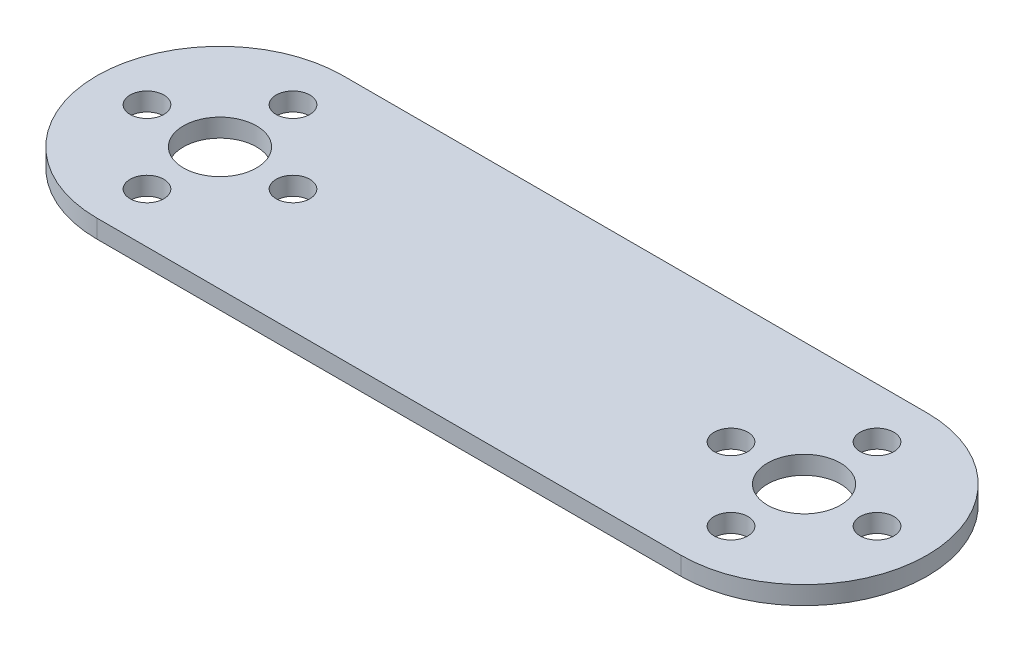
ISO-10303-21;
HEADER;
FILE_DESCRIPTION(('STEP AP214'),'2;1');
FILE_NAME('part.step','',(''),(''),'','','');
FILE_SCHEMA(('AUTOMOTIVE_DESIGN { 1 0 10303 214 1 1 1 1 }'));
ENDSEC;
DATA;
#1=APPLICATION_CONTEXT('core data for automotive mechanical design processes');
#2=APPLICATION_PROTOCOL_DEFINITION('international standard','automotive_design',2000,#1);
#3=PRODUCT_CONTEXT('',#1,'mechanical');
#4=PRODUCT('Part','Part','',(#3));
#5=PRODUCT_RELATED_PRODUCT_CATEGORY('part','',(#4));
#6=PRODUCT_DEFINITION_FORMATION('','',#4);
#7=PRODUCT_DEFINITION_CONTEXT('part definition',#1,'design');
#8=PRODUCT_DEFINITION('design','',#6,#7);
#9=PRODUCT_DEFINITION_SHAPE('','',#8);
#10=(LENGTH_UNIT() NAMED_UNIT(*) SI_UNIT(.MILLI.,.METRE.));
#11=(NAMED_UNIT(*) PLANE_ANGLE_UNIT() SI_UNIT($,.RADIAN.));
#12=(NAMED_UNIT(*) SI_UNIT($,.STERADIAN.) SOLID_ANGLE_UNIT());
#13=UNCERTAINTY_MEASURE_WITH_UNIT(LENGTH_MEASURE(1.E-05),#10,'distance_accuracy_value','');
#14=(GEOMETRIC_REPRESENTATION_CONTEXT(3) GLOBAL_UNCERTAINTY_ASSIGNED_CONTEXT((#13)) GLOBAL_UNIT_ASSIGNED_CONTEXT((#10,
#11,#12)) REPRESENTATION_CONTEXT('',''));
#15=CARTESIAN_POINT('',(0.,0.,0.));
#16=DIRECTION('',(0.,0.,1.));
#17=DIRECTION('',(1.,0.,0.));
#18=AXIS2_PLACEMENT_3D('',#15,#16,#17);
#19=CARTESIAN_POINT('',(-32.,0.,0.));
#20=DIRECTION('',(0.,-1.,0.));
#21=DIRECTION('',(0.,0.,-1.));
#22=AXIS2_PLACEMENT_3D('',#19,#20,#21);
#23=CYLINDRICAL_SURFACE('',#22,13.5);
#24=DIRECTION('',(0.,-1.,0.));
#25=VECTOR('',#24,1.);
#26=CARTESIAN_POINT('',(-32.,2.,-13.5));
#27=LINE('',#26,#25);
#28=CARTESIAN_POINT('',(-32.,0.,-13.5));
#29=VERTEX_POINT('',#28);
#30=CARTESIAN_POINT('',(-32.,2.,-13.5));
#31=VERTEX_POINT('',#30);
#32=EDGE_CURVE('E107',#29,#31,#27,.F.);
#33=ORIENTED_EDGE('',*,*,#32,.F.);
#34=CARTESIAN_POINT('',(-32.,0.,0.));
#35=DIRECTION('',(0.,-1.,0.));
#36=DIRECTION('',(0.,0.,-1.));
#37=AXIS2_PLACEMENT_3D('',#34,#35,#36);
#38=CIRCLE('',#37,13.5);
#39=CARTESIAN_POINT('',(-32.,0.,13.5));
#40=VERTEX_POINT('',#39);
#41=EDGE_CURVE('E24',#40,#29,#38,.T.);
#42=ORIENTED_EDGE('',*,*,#41,.F.);
#43=DIRECTION('',(0.,-1.,0.));
#44=VECTOR('',#43,1.);
#45=CARTESIAN_POINT('',(-32.,2.,13.5));
#46=LINE('',#45,#44);
#47=CARTESIAN_POINT('',(-32.,2.,13.5));
#48=VERTEX_POINT('',#47);
#49=EDGE_CURVE('E74',#48,#40,#46,.T.);
#50=ORIENTED_EDGE('',*,*,#49,.F.);
#51=CARTESIAN_POINT('',(-32.,2.,0.));
#52=DIRECTION('',(0.,-1.,0.));
#53=DIRECTION('',(0.,0.,-1.));
#54=AXIS2_PLACEMENT_3D('',#51,#52,#53);
#55=CIRCLE('',#54,13.5);
#56=EDGE_CURVE('E10',#31,#48,#55,.F.);
#57=ORIENTED_EDGE('',*,*,#56,.F.);
#58=EDGE_LOOP('',(#33,#42,#50,#57));
#59=FACE_BOUND('',#58,.T.);
#60=ADVANCED_FACE('F16',(#59),#23,.T.);
#61=CARTESIAN_POINT('',(32.,0.,0.));
#62=DIRECTION('',(0.,-1.,0.));
#63=DIRECTION('',(0.,0.,-1.));
#64=AXIS2_PLACEMENT_3D('',#61,#62,#63);
#65=CYLINDRICAL_SURFACE('',#64,13.5);
#66=DIRECTION('',(0.,-1.,0.));
#67=VECTOR('',#66,1.);
#68=CARTESIAN_POINT('',(32.,2.,13.5));
#69=LINE('',#68,#67);
#70=CARTESIAN_POINT('',(32.,0.,13.5));
#71=VERTEX_POINT('',#70);
#72=CARTESIAN_POINT('',(32.,2.,13.5));
#73=VERTEX_POINT('',#72);
#74=EDGE_CURVE('E73',#71,#73,#69,.F.);
#75=ORIENTED_EDGE('',*,*,#74,.F.);
#76=CARTESIAN_POINT('',(32.,0.,0.));
#77=DIRECTION('',(0.,-1.,0.));
#78=DIRECTION('',(0.,0.,-1.));
#79=AXIS2_PLACEMENT_3D('',#76,#77,#78);
#80=CIRCLE('',#79,13.5);
#81=CARTESIAN_POINT('',(32.,0.,-13.5));
#82=VERTEX_POINT('',#81);
#83=EDGE_CURVE('E81',#82,#71,#80,.T.);
#84=ORIENTED_EDGE('',*,*,#83,.F.);
#85=DIRECTION('',(0.,-1.,0.));
#86=VECTOR('',#85,1.);
#87=CARTESIAN_POINT('',(32.,2.,-13.5));
#88=LINE('',#87,#86);
#89=CARTESIAN_POINT('',(32.,2.,-13.5));
#90=VERTEX_POINT('',#89);
#91=EDGE_CURVE('E89',#90,#82,#88,.T.);
#92=ORIENTED_EDGE('',*,*,#91,.F.);
#93=CARTESIAN_POINT('',(32.,2.,0.));
#94=DIRECTION('',(0.,-1.,0.));
#95=DIRECTION('',(0.,0.,-1.));
#96=AXIS2_PLACEMENT_3D('',#93,#94,#95);
#97=CIRCLE('',#96,13.5);
#98=EDGE_CURVE('E88',#73,#90,#97,.F.);
#99=ORIENTED_EDGE('',*,*,#98,.F.);
#100=EDGE_LOOP('',(#75,#84,#92,#99));
#101=FACE_BOUND('',#100,.T.);
#102=ADVANCED_FACE('F92',(#101),#65,.T.);
#103=CARTESIAN_POINT('',(-45.5,2.,13.5));
#104=DIRECTION('',(0.,0.,-1.));
#105=DIRECTION('',(-1.,0.,0.));
#106=AXIS2_PLACEMENT_3D('',#103,#104,#105);
#107=PLANE('',#106);
#108=DIRECTION('',(1.,0.,0.));
#109=VECTOR('',#108,1.);
#110=CARTESIAN_POINT('',(-45.5,2.,13.5));
#111=LINE('',#110,#109);
#112=EDGE_CURVE('E101',#48,#73,#111,.T.);
#113=ORIENTED_EDGE('',*,*,#112,.F.);
#114=ORIENTED_EDGE('',*,*,#49,.T.);
#115=DIRECTION('',(1.,0.,0.));
#116=VECTOR('',#115,1.);
#117=CARTESIAN_POINT('',(-45.5,0.,13.5));
#118=LINE('',#117,#116);
#119=EDGE_CURVE('E68',#40,#71,#118,.T.);
#120=ORIENTED_EDGE('',*,*,#119,.T.);
#121=ORIENTED_EDGE('',*,*,#74,.T.);
#122=EDGE_LOOP('',(#113,#114,#120,#121));
#123=FACE_BOUND('',#122,.T.);
#124=ADVANCED_FACE('F71',(#123),#107,.F.);
#125=CARTESIAN_POINT('',(-45.5,2.,-13.5));
#126=DIRECTION('',(0.,0.,1.));
#127=DIRECTION('',(1.,0.,0.));
#128=AXIS2_PLACEMENT_3D('',#125,#126,#127);
#129=PLANE('',#128);
#130=DIRECTION('',(-1.,0.,0.));
#131=VECTOR('',#130,1.);
#132=CARTESIAN_POINT('',(-45.5,0.,-13.5));
#133=LINE('',#132,#131);
#134=EDGE_CURVE('E77',#82,#29,#133,.T.);
#135=ORIENTED_EDGE('',*,*,#134,.T.);
#136=ORIENTED_EDGE('',*,*,#32,.T.);
#137=DIRECTION('',(-1.,0.,0.));
#138=VECTOR('',#137,1.);
#139=CARTESIAN_POINT('',(-45.5,2.,-13.5));
#140=LINE('',#139,#138);
#141=EDGE_CURVE('E94',#90,#31,#140,.T.);
#142=ORIENTED_EDGE('',*,*,#141,.F.);
#143=ORIENTED_EDGE('',*,*,#91,.T.);
#144=EDGE_LOOP('',(#135,#136,#142,#143));
#145=FACE_BOUND('',#144,.T.);
#146=ADVANCED_FACE('F116',(#145),#129,.F.);
#147=CARTESIAN_POINT('',(-45.5,2.,-13.5));
#148=DIRECTION('',(0.,-1.,0.));
#149=DIRECTION('',(0.,0.,-1.));
#150=AXIS2_PLACEMENT_3D('',#147,#148,#149);
#151=PLANE('',#150);
#152=CARTESIAN_POINT('',(32.,2.,-8.));
#153=DIRECTION('',(0.,1.,0.));
#154=DIRECTION('',(0.,0.,1.));
#155=AXIS2_PLACEMENT_3D('',#152,#153,#154);
#156=CIRCLE('',#155,1.85);
#157=CARTESIAN_POINT('',(32.,2.,-6.15));
#158=VERTEX_POINT('',#157);
#159=EDGE_CURVE('E193',#158,#158,#156,.T.);
#160=ORIENTED_EDGE('',*,*,#159,.F.);
#161=EDGE_LOOP('',(#160));
#162=FACE_BOUND('',#161,.T.);
#163=CARTESIAN_POINT('',(32.,2.,8.));
#164=DIRECTION('',(0.,1.,0.));
#165=DIRECTION('',(0.,0.,1.));
#166=AXIS2_PLACEMENT_3D('',#163,#164,#165);
#167=CIRCLE('',#166,1.85);
#168=CARTESIAN_POINT('',(32.,2.,9.85));
#169=VERTEX_POINT('',#168);
#170=EDGE_CURVE('E185',#169,#169,#167,.T.);
#171=ORIENTED_EDGE('',*,*,#170,.F.);
#172=EDGE_LOOP('',(#171));
#173=FACE_BOUND('',#172,.T.);
#174=CARTESIAN_POINT('',(24.,2.,0.));
#175=DIRECTION('',(0.,1.,0.));
#176=DIRECTION('',(0.,0.,1.));
#177=AXIS2_PLACEMENT_3D('',#174,#175,#176);
#178=CIRCLE('',#177,1.85);
#179=CARTESIAN_POINT('',(24.,2.,1.85));
#180=VERTEX_POINT('',#179);
#181=EDGE_CURVE('E177',#180,#180,#178,.T.);
#182=ORIENTED_EDGE('',*,*,#181,.F.);
#183=EDGE_LOOP('',(#182));
#184=FACE_BOUND('',#183,.T.);
#185=CARTESIAN_POINT('',(40.,2.,0.));
#186=DIRECTION('',(0.,1.,0.));
#187=DIRECTION('',(0.,0.,1.));
#188=AXIS2_PLACEMENT_3D('',#185,#186,#187);
#189=CIRCLE('',#188,1.85);
#190=CARTESIAN_POINT('',(40.,2.,1.85));
#191=VERTEX_POINT('',#190);
#192=EDGE_CURVE('E169',#191,#191,#189,.T.);
#193=ORIENTED_EDGE('',*,*,#192,.F.);
#194=EDGE_LOOP('',(#193));
#195=FACE_BOUND('',#194,.T.);
#196=CARTESIAN_POINT('',(32.,2.,0.));
#197=DIRECTION('',(0.,1.,0.));
#198=DIRECTION('',(0.,0.,1.));
#199=AXIS2_PLACEMENT_3D('',#196,#197,#198);
#200=CIRCLE('',#199,4.);
#201=CARTESIAN_POINT('',(32.,2.,4.00000000000001));
#202=VERTEX_POINT('',#201);
#203=EDGE_CURVE('E161',#202,#202,#200,.T.);
#204=ORIENTED_EDGE('',*,*,#203,.F.);
#205=EDGE_LOOP('',(#204));
#206=FACE_BOUND('',#205,.T.);
#207=CARTESIAN_POINT('',(-32.,2.,-8.));
#208=DIRECTION('',(0.,1.,0.));
#209=DIRECTION('',(0.,0.,1.));
#210=AXIS2_PLACEMENT_3D('',#207,#208,#209);
#211=CIRCLE('',#210,1.85);
#212=CARTESIAN_POINT('',(-32.,2.,-6.15));
#213=VERTEX_POINT('',#212);
#214=EDGE_CURVE('E153',#213,#213,#211,.T.);
#215=ORIENTED_EDGE('',*,*,#214,.F.);
#216=EDGE_LOOP('',(#215));
#217=FACE_BOUND('',#216,.T.);
#218=CARTESIAN_POINT('',(-32.,2.,8.));
#219=DIRECTION('',(0.,1.,0.));
#220=DIRECTION('',(0.,0.,1.));
#221=AXIS2_PLACEMENT_3D('',#218,#219,#220);
#222=CIRCLE('',#221,1.85);
#223=CARTESIAN_POINT('',(-32.,2.,9.85));
#224=VERTEX_POINT('',#223);
#225=EDGE_CURVE('E145',#224,#224,#222,.T.);
#226=ORIENTED_EDGE('',*,*,#225,.F.);
#227=EDGE_LOOP('',(#226));
#228=FACE_BOUND('',#227,.T.);
#229=CARTESIAN_POINT('',(-40.,2.,0.));
#230=DIRECTION('',(0.,1.,0.));
#231=DIRECTION('',(0.,0.,1.));
#232=AXIS2_PLACEMENT_3D('',#229,#230,#231);
#233=CIRCLE('',#232,1.85);
#234=CARTESIAN_POINT('',(-40.,2.,1.85));
#235=VERTEX_POINT('',#234);
#236=EDGE_CURVE('E137',#235,#235,#233,.T.);
#237=ORIENTED_EDGE('',*,*,#236,.F.);
#238=EDGE_LOOP('',(#237));
#239=FACE_BOUND('',#238,.T.);
#240=CARTESIAN_POINT('',(-24.,2.,0.));
#241=DIRECTION('',(0.,1.,0.));
#242=DIRECTION('',(0.,0.,1.));
#243=AXIS2_PLACEMENT_3D('',#240,#241,#242);
#244=CIRCLE('',#243,1.85);
#245=CARTESIAN_POINT('',(-24.,2.,1.85));
#246=VERTEX_POINT('',#245);
#247=EDGE_CURVE('E129',#246,#246,#244,.T.);
#248=ORIENTED_EDGE('',*,*,#247,.F.);
#249=EDGE_LOOP('',(#248));
#250=FACE_BOUND('',#249,.T.);
#251=CARTESIAN_POINT('',(-32.,2.,0.));
#252=DIRECTION('',(0.,1.,0.));
#253=DIRECTION('',(0.,0.,1.));
#254=AXIS2_PLACEMENT_3D('',#251,#252,#253);
#255=CIRCLE('',#254,4.);
#256=CARTESIAN_POINT('',(-32.,2.,4.00000000000001));
#257=VERTEX_POINT('',#256);
#258=EDGE_CURVE('E78',#257,#257,#255,.T.);
#259=ORIENTED_EDGE('',*,*,#258,.F.);
#260=EDGE_LOOP('',(#259));
#261=FACE_BOUND('',#260,.T.);
#262=ORIENTED_EDGE('',*,*,#141,.T.);
#263=ORIENTED_EDGE('',*,*,#56,.T.);
#264=ORIENTED_EDGE('',*,*,#112,.T.);
#265=ORIENTED_EDGE('',*,*,#98,.T.);
#266=EDGE_LOOP('',(#262,#263,#264,#265));
#267=FACE_BOUND('',#266,.T.);
#268=ADVANCED_FACE('F214',(#162,#173,#184,#195,#206,#217,#228,#239,#250,#261,#267),#151,.F.);
#269=CARTESIAN_POINT('',(-45.5,0.,-13.5));
#270=DIRECTION('',(0.,-1.,0.));
#271=DIRECTION('',(0.,0.,-1.));
#272=AXIS2_PLACEMENT_3D('',#269,#270,#271);
#273=PLANE('',#272);
#274=CARTESIAN_POINT('',(32.,0.,-8.));
#275=DIRECTION('',(0.,1.,0.));
#276=DIRECTION('',(0.,0.,1.));
#277=AXIS2_PLACEMENT_3D('',#274,#275,#276);
#278=CIRCLE('',#277,1.85);
#279=CARTESIAN_POINT('',(32.,0.,-6.15));
#280=VERTEX_POINT('',#279);
#281=EDGE_CURVE('E197',#280,#280,#278,.T.);
#282=ORIENTED_EDGE('',*,*,#281,.T.);
#283=EDGE_LOOP('',(#282));
#284=FACE_BOUND('',#283,.T.);
#285=CARTESIAN_POINT('',(32.,0.,8.));
#286=DIRECTION('',(0.,1.,0.));
#287=DIRECTION('',(0.,0.,1.));
#288=AXIS2_PLACEMENT_3D('',#285,#286,#287);
#289=CIRCLE('',#288,1.85);
#290=CARTESIAN_POINT('',(32.,0.,9.85));
#291=VERTEX_POINT('',#290);
#292=EDGE_CURVE('E189',#291,#291,#289,.T.);
#293=ORIENTED_EDGE('',*,*,#292,.T.);
#294=EDGE_LOOP('',(#293));
#295=FACE_BOUND('',#294,.T.);
#296=CARTESIAN_POINT('',(24.,0.,0.));
#297=DIRECTION('',(0.,1.,0.));
#298=DIRECTION('',(0.,0.,1.));
#299=AXIS2_PLACEMENT_3D('',#296,#297,#298);
#300=CIRCLE('',#299,1.85);
#301=CARTESIAN_POINT('',(24.,0.,1.85));
#302=VERTEX_POINT('',#301);
#303=EDGE_CURVE('E181',#302,#302,#300,.T.);
#304=ORIENTED_EDGE('',*,*,#303,.T.);
#305=EDGE_LOOP('',(#304));
#306=FACE_BOUND('',#305,.T.);
#307=CARTESIAN_POINT('',(40.,0.,0.));
#308=DIRECTION('',(0.,1.,0.));
#309=DIRECTION('',(0.,0.,1.));
#310=AXIS2_PLACEMENT_3D('',#307,#308,#309);
#311=CIRCLE('',#310,1.85);
#312=CARTESIAN_POINT('',(40.,0.,1.85));
#313=VERTEX_POINT('',#312);
#314=EDGE_CURVE('E173',#313,#313,#311,.T.);
#315=ORIENTED_EDGE('',*,*,#314,.T.);
#316=EDGE_LOOP('',(#315));
#317=FACE_BOUND('',#316,.T.);
#318=CARTESIAN_POINT('',(32.,0.,0.));
#319=DIRECTION('',(0.,1.,0.));
#320=DIRECTION('',(0.,0.,1.));
#321=AXIS2_PLACEMENT_3D('',#318,#319,#320);
#322=CIRCLE('',#321,4.);
#323=CARTESIAN_POINT('',(32.,0.,4.00000000000001));
#324=VERTEX_POINT('',#323);
#325=EDGE_CURVE('E165',#324,#324,#322,.T.);
#326=ORIENTED_EDGE('',*,*,#325,.T.);
#327=EDGE_LOOP('',(#326));
#328=FACE_BOUND('',#327,.T.);
#329=CARTESIAN_POINT('',(-32.,0.,-8.));
#330=DIRECTION('',(0.,1.,0.));
#331=DIRECTION('',(0.,0.,1.));
#332=AXIS2_PLACEMENT_3D('',#329,#330,#331);
#333=CIRCLE('',#332,1.85);
#334=CARTESIAN_POINT('',(-32.,0.,-6.15));
#335=VERTEX_POINT('',#334);
#336=EDGE_CURVE('E157',#335,#335,#333,.T.);
#337=ORIENTED_EDGE('',*,*,#336,.T.);
#338=EDGE_LOOP('',(#337));
#339=FACE_BOUND('',#338,.T.);
#340=CARTESIAN_POINT('',(-32.,0.,8.));
#341=DIRECTION('',(0.,1.,0.));
#342=DIRECTION('',(0.,0.,1.));
#343=AXIS2_PLACEMENT_3D('',#340,#341,#342);
#344=CIRCLE('',#343,1.85);
#345=CARTESIAN_POINT('',(-32.,0.,9.85));
#346=VERTEX_POINT('',#345);
#347=EDGE_CURVE('E149',#346,#346,#344,.T.);
#348=ORIENTED_EDGE('',*,*,#347,.T.);
#349=EDGE_LOOP('',(#348));
#350=FACE_BOUND('',#349,.T.);
#351=CARTESIAN_POINT('',(-40.,0.,0.));
#352=DIRECTION('',(0.,1.,0.));
#353=DIRECTION('',(0.,0.,1.));
#354=AXIS2_PLACEMENT_3D('',#351,#352,#353);
#355=CIRCLE('',#354,1.85);
#356=CARTESIAN_POINT('',(-40.,0.,1.85));
#357=VERTEX_POINT('',#356);
#358=EDGE_CURVE('E141',#357,#357,#355,.T.);
#359=ORIENTED_EDGE('',*,*,#358,.T.);
#360=EDGE_LOOP('',(#359));
#361=FACE_BOUND('',#360,.T.);
#362=CARTESIAN_POINT('',(-24.,0.,0.));
#363=DIRECTION('',(0.,1.,0.));
#364=DIRECTION('',(0.,0.,1.));
#365=AXIS2_PLACEMENT_3D('',#362,#363,#364);
#366=CIRCLE('',#365,1.85);
#367=CARTESIAN_POINT('',(-24.,0.,1.85));
#368=VERTEX_POINT('',#367);
#369=EDGE_CURVE('E133',#368,#368,#366,.T.);
#370=ORIENTED_EDGE('',*,*,#369,.T.);
#371=EDGE_LOOP('',(#370));
#372=FACE_BOUND('',#371,.T.);
#373=CARTESIAN_POINT('',(-32.,0.,0.));
#374=DIRECTION('',(0.,1.,0.));
#375=DIRECTION('',(0.,0.,1.));
#376=AXIS2_PLACEMENT_3D('',#373,#374,#375);
#377=CIRCLE('',#376,4.);
#378=CARTESIAN_POINT('',(-32.,0.,4.00000000000001));
#379=VERTEX_POINT('',#378);
#380=EDGE_CURVE('E125',#379,#379,#377,.T.);
#381=ORIENTED_EDGE('',*,*,#380,.T.);
#382=EDGE_LOOP('',(#381));
#383=FACE_BOUND('',#382,.T.);
#384=ORIENTED_EDGE('',*,*,#119,.F.);
#385=ORIENTED_EDGE('',*,*,#41,.T.);
#386=ORIENTED_EDGE('',*,*,#134,.F.);
#387=ORIENTED_EDGE('',*,*,#83,.T.);
#388=EDGE_LOOP('',(#384,#385,#386,#387));
#389=FACE_BOUND('',#388,.T.);
#390=ADVANCED_FACE('F82',(#284,#295,#306,#317,#328,#339,#350,#361,#372,#383,#389),#273,.T.);
#391=CARTESIAN_POINT('',(-32.,0.,0.));
#392=DIRECTION('',(0.,1.,0.));
#393=DIRECTION('',(0.,0.,1.));
#394=AXIS2_PLACEMENT_3D('',#391,#392,#393);
#395=CYLINDRICAL_SURFACE('',#394,4.);
#396=ORIENTED_EDGE('',*,*,#380,.F.);
#397=EDGE_LOOP('',(#396));
#398=FACE_BOUND('',#397,.T.);
#399=ORIENTED_EDGE('',*,*,#258,.T.);
#400=EDGE_LOOP('',(#399));
#401=FACE_BOUND('',#400,.T.);
#402=ADVANCED_FACE('F236',(#398,#401),#395,.F.);
#403=CARTESIAN_POINT('',(-24.,0.,0.));
#404=DIRECTION('',(0.,1.,0.));
#405=DIRECTION('',(0.,0.,1.));
#406=AXIS2_PLACEMENT_3D('',#403,#404,#405);
#407=CYLINDRICAL_SURFACE('',#406,1.85);
#408=ORIENTED_EDGE('',*,*,#369,.F.);
#409=EDGE_LOOP('',(#408));
#410=FACE_BOUND('',#409,.T.);
#411=ORIENTED_EDGE('',*,*,#247,.T.);
#412=EDGE_LOOP('',(#411));
#413=FACE_BOUND('',#412,.T.);
#414=ADVANCED_FACE('F238',(#410,#413),#407,.F.);
#415=CARTESIAN_POINT('',(-40.,0.,0.));
#416=DIRECTION('',(0.,1.,0.));
#417=DIRECTION('',(0.,0.,1.));
#418=AXIS2_PLACEMENT_3D('',#415,#416,#417);
#419=CYLINDRICAL_SURFACE('',#418,1.85);
#420=ORIENTED_EDGE('',*,*,#358,.F.);
#421=EDGE_LOOP('',(#420));
#422=FACE_BOUND('',#421,.T.);
#423=ORIENTED_EDGE('',*,*,#236,.T.);
#424=EDGE_LOOP('',(#423));
#425=FACE_BOUND('',#424,.T.);
#426=ADVANCED_FACE('F246',(#422,#425),#419,.F.);
#427=CARTESIAN_POINT('',(-32.,0.,8.));
#428=DIRECTION('',(0.,1.,0.));
#429=DIRECTION('',(0.,0.,1.));
#430=AXIS2_PLACEMENT_3D('',#427,#428,#429);
#431=CYLINDRICAL_SURFACE('',#430,1.85);
#432=ORIENTED_EDGE('',*,*,#347,.F.);
#433=EDGE_LOOP('',(#432));
#434=FACE_BOUND('',#433,.T.);
#435=ORIENTED_EDGE('',*,*,#225,.T.);
#436=EDGE_LOOP('',(#435));
#437=FACE_BOUND('',#436,.T.);
#438=ADVANCED_FACE('F302',(#434,#437),#431,.F.);
#439=CARTESIAN_POINT('',(-32.,0.,-8.));
#440=DIRECTION('',(0.,1.,0.));
#441=DIRECTION('',(0.,0.,1.));
#442=AXIS2_PLACEMENT_3D('',#439,#440,#441);
#443=CYLINDRICAL_SURFACE('',#442,1.85);
#444=ORIENTED_EDGE('',*,*,#336,.F.);
#445=EDGE_LOOP('',(#444));
#446=FACE_BOUND('',#445,.T.);
#447=ORIENTED_EDGE('',*,*,#214,.T.);
#448=EDGE_LOOP('',(#447));
#449=FACE_BOUND('',#448,.T.);
#450=ADVANCED_FACE('F313',(#446,#449),#443,.F.);
#451=CARTESIAN_POINT('',(32.,0.,0.));
#452=DIRECTION('',(0.,1.,0.));
#453=DIRECTION('',(0.,0.,1.));
#454=AXIS2_PLACEMENT_3D('',#451,#452,#453);
#455=CYLINDRICAL_SURFACE('',#454,4.);
#456=ORIENTED_EDGE('',*,*,#325,.F.);
#457=EDGE_LOOP('',(#456));
#458=FACE_BOUND('',#457,.T.);
#459=ORIENTED_EDGE('',*,*,#203,.T.);
#460=EDGE_LOOP('',(#459));
#461=FACE_BOUND('',#460,.T.);
#462=ADVANCED_FACE('F324',(#458,#461),#455,.F.);
#463=CARTESIAN_POINT('',(40.,0.,0.));
#464=DIRECTION('',(0.,1.,0.));
#465=DIRECTION('',(0.,0.,1.));
#466=AXIS2_PLACEMENT_3D('',#463,#464,#465);
#467=CYLINDRICAL_SURFACE('',#466,1.85);
#468=ORIENTED_EDGE('',*,*,#314,.F.);
#469=EDGE_LOOP('',(#468));
#470=FACE_BOUND('',#469,.T.);
#471=ORIENTED_EDGE('',*,*,#192,.T.);
#472=EDGE_LOOP('',(#471));
#473=FACE_BOUND('',#472,.T.);
#474=ADVANCED_FACE('F335',(#470,#473),#467,.F.);
#475=CARTESIAN_POINT('',(24.,0.,0.));
#476=DIRECTION('',(0.,1.,0.));
#477=DIRECTION('',(0.,0.,1.));
#478=AXIS2_PLACEMENT_3D('',#475,#476,#477);
#479=CYLINDRICAL_SURFACE('',#478,1.85);
#480=ORIENTED_EDGE('',*,*,#303,.F.);
#481=EDGE_LOOP('',(#480));
#482=FACE_BOUND('',#481,.T.);
#483=ORIENTED_EDGE('',*,*,#181,.T.);
#484=EDGE_LOOP('',(#483));
#485=FACE_BOUND('',#484,.T.);
#486=ADVANCED_FACE('F346',(#482,#485),#479,.F.);
#487=CARTESIAN_POINT('',(32.,0.,8.));
#488=DIRECTION('',(0.,1.,0.));
#489=DIRECTION('',(0.,0.,1.));
#490=AXIS2_PLACEMENT_3D('',#487,#488,#489);
#491=CYLINDRICAL_SURFACE('',#490,1.85);
#492=ORIENTED_EDGE('',*,*,#292,.F.);
#493=EDGE_LOOP('',(#492));
#494=FACE_BOUND('',#493,.T.);
#495=ORIENTED_EDGE('',*,*,#170,.T.);
#496=EDGE_LOOP('',(#495));
#497=FACE_BOUND('',#496,.T.);
#498=ADVANCED_FACE('F210',(#494,#497),#491,.F.);
#499=CARTESIAN_POINT('',(32.,0.,-8.));
#500=DIRECTION('',(0.,1.,0.));
#501=DIRECTION('',(0.,0.,1.));
#502=AXIS2_PLACEMENT_3D('',#499,#500,#501);
#503=CYLINDRICAL_SURFACE('',#502,1.85);
#504=ORIENTED_EDGE('',*,*,#281,.F.);
#505=EDGE_LOOP('',(#504));
#506=FACE_BOUND('',#505,.T.);
#507=ORIENTED_EDGE('',*,*,#159,.T.);
#508=EDGE_LOOP('',(#507));
#509=FACE_BOUND('',#508,.T.);
#510=ADVANCED_FACE('F207',(#506,#509),#503,.F.);
#511=CLOSED_SHELL('',(#60,#102,#124,#146,#268,#390,#402,#414,#426,#438,#450,#462,#474,#486,#498,#510));
#512=MANIFOLD_SOLID_BREP('B1',#511);
#513=ADVANCED_BREP_SHAPE_REPRESENTATION('',(#18,#512),#14);
#514=SHAPE_DEFINITION_REPRESENTATION(#9,#513);
ENDSEC;
END-ISO-10303-21;
